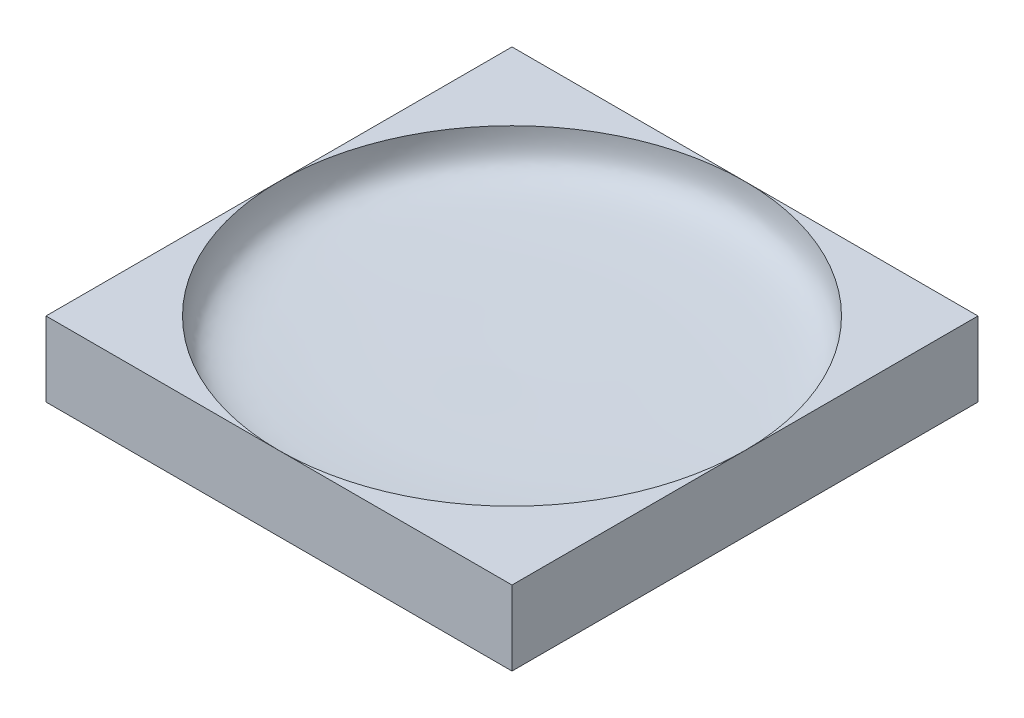
ISO-10303-21;
HEADER;
FILE_DESCRIPTION(('STEP AP214'),'2;1');
FILE_NAME('part.step','',(''),(''),'','','');
FILE_SCHEMA(('AUTOMOTIVE_DESIGN { 1 0 10303 214 1 1 1 1 }'));
ENDSEC;
DATA;
#1=APPLICATION_CONTEXT('core data for automotive mechanical design processes');
#2=APPLICATION_PROTOCOL_DEFINITION('international standard','automotive_design',2000,#1);
#3=PRODUCT_CONTEXT('',#1,'mechanical');
#4=PRODUCT('Part','Part','',(#3));
#5=PRODUCT_RELATED_PRODUCT_CATEGORY('part','',(#4));
#6=PRODUCT_DEFINITION_FORMATION('','',#4);
#7=PRODUCT_DEFINITION_CONTEXT('part definition',#1,'design');
#8=PRODUCT_DEFINITION('design','',#6,#7);
#9=PRODUCT_DEFINITION_SHAPE('','',#8);
#10=(LENGTH_UNIT() NAMED_UNIT(*) SI_UNIT(.MILLI.,.METRE.));
#11=(NAMED_UNIT(*) PLANE_ANGLE_UNIT() SI_UNIT($,.RADIAN.));
#12=(NAMED_UNIT(*) SI_UNIT($,.STERADIAN.) SOLID_ANGLE_UNIT());
#13=UNCERTAINTY_MEASURE_WITH_UNIT(LENGTH_MEASURE(1.E-05),#10,'distance_accuracy_value','');
#14=(GEOMETRIC_REPRESENTATION_CONTEXT(3) GLOBAL_UNCERTAINTY_ASSIGNED_CONTEXT((#13)) GLOBAL_UNIT_ASSIGNED_CONTEXT((#10,
#11,#12)) REPRESENTATION_CONTEXT('',''));
#15=CARTESIAN_POINT('',(0.,0.,0.));
#16=DIRECTION('',(0.,0.,1.));
#17=DIRECTION('',(1.,0.,0.));
#18=AXIS2_PLACEMENT_3D('',#15,#16,#17);
#19=CARTESIAN_POINT('',(0.,40.,0.));
#20=DIRECTION('',(0.,1.,0.));
#21=DIRECTION('',(0.,0.,1.));
#22=AXIS2_PLACEMENT_3D('',#19,#20,#21);
#23=PLANE('',#22);
#24=CARTESIAN_POINT('',(0.,40.,0.));
#25=DIRECTION('',(0.,1.,0.));
#26=DIRECTION('',(0.,0.,1.));
#27=AXIS2_PLACEMENT_3D('',#24,#25,#26);
#28=CIRCLE('',#27,125.);
#29=CARTESIAN_POINT('',(0.,40.,125.));
#30=VERTEX_POINT('',#29);
#31=CARTESIAN_POINT('',(125.,40.,0.));
#32=VERTEX_POINT('',#31);
#33=EDGE_CURVE('E11',#30,#32,#28,.T.);
#34=ORIENTED_EDGE('',*,*,#33,.F.);
#35=DIRECTION('',(1.,0.,0.));
#36=VECTOR('',#35,1.);
#37=CARTESIAN_POINT('',(-125.,40.,125.));
#38=LINE('',#37,#36);
#39=CARTESIAN_POINT('',(125.,40.,125.));
#40=VERTEX_POINT('',#39);
#41=EDGE_CURVE('E166',#30,#40,#38,.T.);
#42=ORIENTED_EDGE('',*,*,#41,.T.);
#43=DIRECTION('',(0.,0.,-1.));
#44=VECTOR('',#43,1.);
#45=CARTESIAN_POINT('',(125.,40.,-125.));
#46=LINE('',#45,#44);
#47=EDGE_CURVE('E137',#40,#32,#46,.T.);
#48=ORIENTED_EDGE('',*,*,#47,.T.);
#49=EDGE_LOOP('',(#34,#42,#48));
#50=FACE_BOUND('',#49,.T.);
#51=ADVANCED_FACE('F33',(#50),#23,.T.);
#52=CARTESIAN_POINT('',(0.,40.,0.));
#53=DIRECTION('',(0.,-1.,0.));
#54=DIRECTION('',(0.,0.,-1.));
#55=AXIS2_PLACEMENT_3D('',#52,#53,#54);
#56=CIRCLE('',#55,125.);
#57=CARTESIAN_POINT('',(0.,40.,-125.));
#58=VERTEX_POINT('',#57);
#59=EDGE_CURVE('E140',#58,#32,#56,.T.);
#60=ORIENTED_EDGE('',*,*,#59,.T.);
#61=CARTESIAN_POINT('',(125.,40.,-125.));
#62=VERTEX_POINT('',#61);
#63=EDGE_CURVE('E142',#32,#62,#46,.T.);
#64=ORIENTED_EDGE('',*,*,#63,.T.);
#65=DIRECTION('',(-1.,0.,0.));
#66=VECTOR('',#65,1.);
#67=CARTESIAN_POINT('',(-125.,40.,-125.));
#68=LINE('',#67,#66);
#69=EDGE_CURVE('E135',#62,#58,#68,.T.);
#70=ORIENTED_EDGE('',*,*,#69,.T.);
#71=EDGE_LOOP('',(#60,#64,#70));
#72=FACE_BOUND('',#71,.T.);
#73=ADVANCED_FACE('F110',(#72),#23,.T.);
#74=CARTESIAN_POINT('',(-125.,40.,0.));
#75=VERTEX_POINT('',#74);
#76=EDGE_CURVE('E42',#58,#75,#28,.T.);
#77=ORIENTED_EDGE('',*,*,#76,.F.);
#78=CARTESIAN_POINT('',(-125.,40.,-125.));
#79=VERTEX_POINT('',#78);
#80=EDGE_CURVE('E56',#58,#79,#68,.T.);
#81=ORIENTED_EDGE('',*,*,#80,.T.);
#82=DIRECTION('',(0.,0.,1.));
#83=VECTOR('',#82,1.);
#84=CARTESIAN_POINT('',(-125.,40.,-125.));
#85=LINE('',#84,#83);
#86=EDGE_CURVE('E132',#79,#75,#85,.T.);
#87=ORIENTED_EDGE('',*,*,#86,.T.);
#88=EDGE_LOOP('',(#77,#81,#87));
#89=FACE_BOUND('',#88,.T.);
#90=ADVANCED_FACE('F115',(#89),#23,.T.);
#91=CARTESIAN_POINT('',(-125.,40.,-125.));
#92=DIRECTION('',(1.,0.,0.));
#93=DIRECTION('',(0.,0.,-1.));
#94=AXIS2_PLACEMENT_3D('',#91,#92,#93);
#95=PLANE('',#94);
#96=DIRECTION('',(0.,0.,1.));
#97=VECTOR('',#96,1.);
#98=CARTESIAN_POINT('',(-125.,0.,-125.));
#99=LINE('',#98,#97);
#100=CARTESIAN_POINT('',(-125.,0.,-125.));
#101=VERTEX_POINT('',#100);
#102=CARTESIAN_POINT('',(-125.,0.,125.));
#103=VERTEX_POINT('',#102);
#104=EDGE_CURVE('E149',#101,#103,#99,.T.);
#105=ORIENTED_EDGE('',*,*,#104,.T.);
#106=DIRECTION('',(0.,-1.,0.));
#107=VECTOR('',#106,1.);
#108=CARTESIAN_POINT('',(-125.,40.,125.));
#109=LINE('',#108,#107);
#110=CARTESIAN_POINT('',(-125.,40.,125.));
#111=VERTEX_POINT('',#110);
#112=EDGE_CURVE('E160',#111,#103,#109,.T.);
#113=ORIENTED_EDGE('',*,*,#112,.F.);
#114=EDGE_CURVE('E85',#75,#111,#85,.T.);
#115=ORIENTED_EDGE('',*,*,#114,.F.);
#116=ORIENTED_EDGE('',*,*,#86,.F.);
#117=DIRECTION('',(0.,-1.,0.));
#118=VECTOR('',#117,1.);
#119=CARTESIAN_POINT('',(-125.,40.,-125.));
#120=LINE('',#119,#118);
#121=EDGE_CURVE('E136',#79,#101,#120,.T.);
#122=ORIENTED_EDGE('',*,*,#121,.T.);
#123=EDGE_LOOP('',(#105,#113,#115,#116,#122));
#124=FACE_BOUND('',#123,.T.);
#125=ADVANCED_FACE('F35',(#124),#95,.F.);
#126=CARTESIAN_POINT('',(-125.,40.,125.));
#127=DIRECTION('',(0.,0.,-1.));
#128=DIRECTION('',(-1.,0.,0.));
#129=AXIS2_PLACEMENT_3D('',#126,#127,#128);
#130=PLANE('',#129);
#131=DIRECTION('',(1.,0.,0.));
#132=VECTOR('',#131,1.);
#133=CARTESIAN_POINT('',(-125.,0.,125.));
#134=LINE('',#133,#132);
#135=CARTESIAN_POINT('',(125.,0.,125.));
#136=VERTEX_POINT('',#135);
#137=EDGE_CURVE('E152',#103,#136,#134,.T.);
#138=ORIENTED_EDGE('',*,*,#137,.T.);
#139=DIRECTION('',(0.,-1.,0.));
#140=VECTOR('',#139,1.);
#141=CARTESIAN_POINT('',(125.,40.,125.));
#142=LINE('',#141,#140);
#143=EDGE_CURVE('E158',#40,#136,#142,.T.);
#144=ORIENTED_EDGE('',*,*,#143,.F.);
#145=ORIENTED_EDGE('',*,*,#41,.F.);
#146=EDGE_CURVE('E169',#111,#30,#38,.T.);
#147=ORIENTED_EDGE('',*,*,#146,.F.);
#148=ORIENTED_EDGE('',*,*,#112,.T.);
#149=EDGE_LOOP('',(#138,#144,#145,#147,#148));
#150=FACE_BOUND('',#149,.T.);
#151=ADVANCED_FACE('F129',(#150),#130,.F.);
#152=CARTESIAN_POINT('',(125.,40.,-125.));
#153=DIRECTION('',(-1.,0.,0.));
#154=DIRECTION('',(0.,0.,1.));
#155=AXIS2_PLACEMENT_3D('',#152,#153,#154);
#156=PLANE('',#155);
#157=DIRECTION('',(0.,0.,-1.));
#158=VECTOR('',#157,1.);
#159=CARTESIAN_POINT('',(125.,0.,-125.));
#160=LINE('',#159,#158);
#161=CARTESIAN_POINT('',(125.,0.,-125.));
#162=VERTEX_POINT('',#161);
#163=EDGE_CURVE('E154',#136,#162,#160,.T.);
#164=ORIENTED_EDGE('',*,*,#163,.T.);
#165=DIRECTION('',(0.,-1.,0.));
#166=VECTOR('',#165,1.);
#167=CARTESIAN_POINT('',(125.,40.,-125.));
#168=LINE('',#167,#166);
#169=EDGE_CURVE('E144',#62,#162,#168,.T.);
#170=ORIENTED_EDGE('',*,*,#169,.F.);
#171=ORIENTED_EDGE('',*,*,#63,.F.);
#172=ORIENTED_EDGE('',*,*,#47,.F.);
#173=ORIENTED_EDGE('',*,*,#143,.T.);
#174=EDGE_LOOP('',(#164,#170,#171,#172,#173));
#175=FACE_BOUND('',#174,.T.);
#176=ADVANCED_FACE('F123',(#175),#156,.F.);
#177=CARTESIAN_POINT('',(-125.,40.,-125.));
#178=DIRECTION('',(0.,0.,1.));
#179=DIRECTION('',(1.,0.,0.));
#180=AXIS2_PLACEMENT_3D('',#177,#178,#179);
#181=PLANE('',#180);
#182=DIRECTION('',(-1.,0.,0.));
#183=VECTOR('',#182,1.);
#184=CARTESIAN_POINT('',(-125.,0.,-125.));
#185=LINE('',#184,#183);
#186=EDGE_CURVE('E78',#162,#101,#185,.T.);
#187=ORIENTED_EDGE('',*,*,#186,.T.);
#188=ORIENTED_EDGE('',*,*,#121,.F.);
#189=ORIENTED_EDGE('',*,*,#80,.F.);
#190=ORIENTED_EDGE('',*,*,#69,.F.);
#191=ORIENTED_EDGE('',*,*,#169,.T.);
#192=EDGE_LOOP('',(#187,#188,#189,#190,#191));
#193=FACE_BOUND('',#192,.T.);
#194=ADVANCED_FACE('F119',(#193),#181,.F.);
#195=EDGE_CURVE('E37',#75,#30,#28,.T.);
#196=ORIENTED_EDGE('',*,*,#195,.F.);
#197=ORIENTED_EDGE('',*,*,#114,.T.);
#198=ORIENTED_EDGE('',*,*,#146,.T.);
#199=EDGE_LOOP('',(#196,#197,#198));
#200=FACE_BOUND('',#199,.T.);
#201=ADVANCED_FACE('F104',(#200),#23,.T.);
#202=CARTESIAN_POINT('',(0.,0.,0.));
#203=DIRECTION('',(0.,1.,0.));
#204=DIRECTION('',(0.,0.,1.));
#205=AXIS2_PLACEMENT_3D('',#202,#203,#204);
#206=PLANE('',#205);
#207=ORIENTED_EDGE('',*,*,#104,.F.);
#208=ORIENTED_EDGE('',*,*,#186,.F.);
#209=ORIENTED_EDGE('',*,*,#163,.F.);
#210=ORIENTED_EDGE('',*,*,#137,.F.);
#211=EDGE_LOOP('',(#207,#208,#209,#210));
#212=FACE_BOUND('',#211,.T.);
#213=ADVANCED_FACE('F99',(#212),#206,.F.);
#214=CARTESIAN_POINT('',(0.,15.,0.));
#215=CARTESIAN_POINT('',(48.1962467998997,15.8823562013494,0.));
#216=CARTESIAN_POINT('',(65.959558565356,14.6973304681963,0.));
#217=CARTESIAN_POINT('',(121.032855802586,18.9178933749405,0.));
#218=CARTESIAN_POINT('',(125.,29.7121772832571,0.));
#219=CARTESIAN_POINT('',(125.,40.,0.));
#220=B_SPLINE_CURVE_WITH_KNOTS('',3,(#214,#215,#216,#217,#218,#219),.UNSPECIFIED.,.F.,.F.,(4,1,
1,4),(0.,0.694215698287871,0.861705647801879,1.),.UNSPECIFIED.);
#221=CARTESIAN_POINT('',(0.,15.,0.));
#222=DIRECTION('',(0.,-1.,0.));
#223=AXIS1_PLACEMENT('',#221,#222);
#224=SURFACE_OF_REVOLUTION('',#220,#223);
#225=ORIENTED_EDGE('',*,*,#59,.F.);
#226=ORIENTED_EDGE('',*,*,#76,.T.);
#227=ORIENTED_EDGE('',*,*,#195,.T.);
#228=ORIENTED_EDGE('',*,*,#33,.T.);
#229=EDGE_LOOP('',(#225,#226,#227,#228));
#230=FACE_BOUND('',#229,.T.);
#231=CARTESIAN_POINT('',(0.,15.,0.));
#232=VERTEX_POINT('',#231);
#233=VERTEX_LOOP('',#232);
#234=FACE_BOUND('',#233,.T.);
#235=ADVANCED_FACE('F97',(#230,#234),#224,.T.);
#236=CLOSED_SHELL('',(#51,#73,#90,#125,#151,#176,#194,#201,#213,#235));
#237=MANIFOLD_SOLID_BREP('B2',#236);
#238=ADVANCED_BREP_SHAPE_REPRESENTATION('',(#18,#237),#14);
#239=SHAPE_DEFINITION_REPRESENTATION(#9,#238);
ENDSEC;
END-ISO-10303-21;
